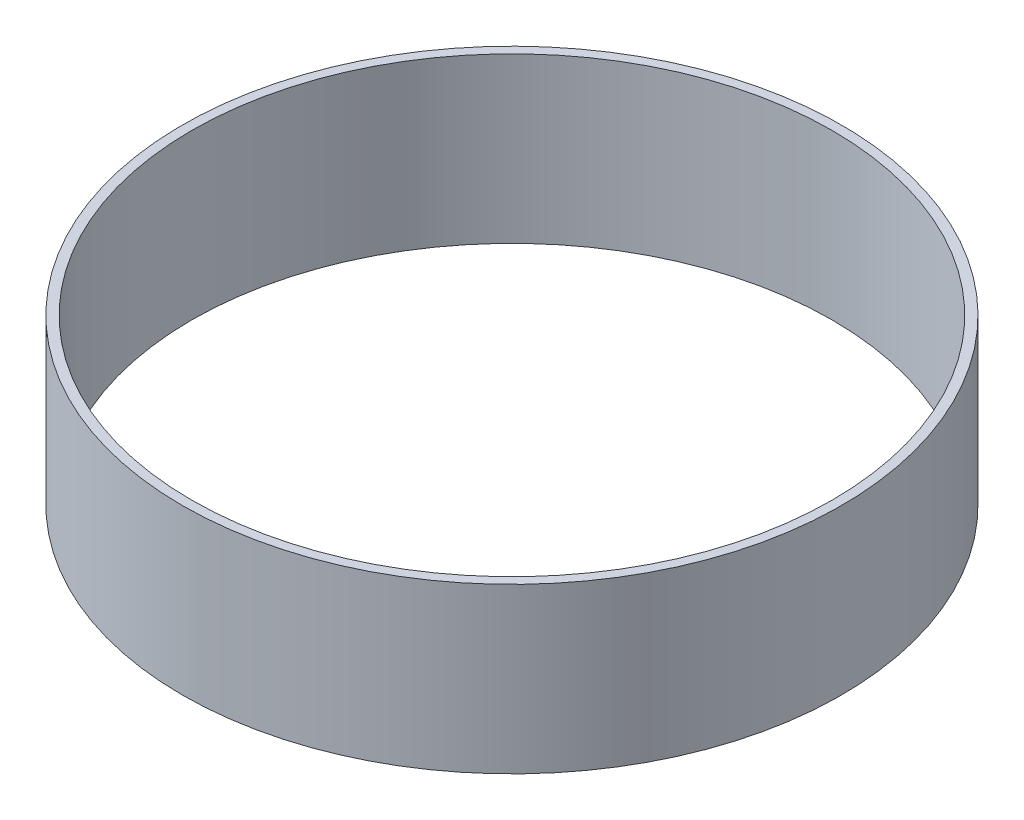
ISO-10303-21;
HEADER;
FILE_DESCRIPTION(('STEP AP214'),'2;1');
FILE_NAME('part.step','',(''),(''),'','','');
FILE_SCHEMA(('AUTOMOTIVE_DESIGN { 1 0 10303 214 1 1 1 1 }'));
ENDSEC;
DATA;
#1=APPLICATION_CONTEXT('core data for automotive mechanical design processes');
#2=APPLICATION_PROTOCOL_DEFINITION('international standard','automotive_design',2000,#1);
#3=PRODUCT_CONTEXT('',#1,'mechanical');
#4=PRODUCT('Part','Part','',(#3));
#5=PRODUCT_RELATED_PRODUCT_CATEGORY('part','',(#4));
#6=PRODUCT_DEFINITION_FORMATION('','',#4);
#7=PRODUCT_DEFINITION_CONTEXT('part definition',#1,'design');
#8=PRODUCT_DEFINITION('design','',#6,#7);
#9=PRODUCT_DEFINITION_SHAPE('','',#8);
#10=(LENGTH_UNIT() NAMED_UNIT(*) SI_UNIT(.MILLI.,.METRE.));
#11=(NAMED_UNIT(*) PLANE_ANGLE_UNIT() SI_UNIT($,.RADIAN.));
#12=(NAMED_UNIT(*) SI_UNIT($,.STERADIAN.) SOLID_ANGLE_UNIT());
#13=UNCERTAINTY_MEASURE_WITH_UNIT(LENGTH_MEASURE(1.E-05),#10,'distance_accuracy_value','');
#14=(GEOMETRIC_REPRESENTATION_CONTEXT(3) GLOBAL_UNCERTAINTY_ASSIGNED_CONTEXT((#13)) GLOBAL_UNIT_ASSIGNED_CONTEXT((#10,
#11,#12)) REPRESENTATION_CONTEXT('',''));
#15=CARTESIAN_POINT('',(0.,0.,0.));
#16=DIRECTION('',(0.,0.,1.));
#17=DIRECTION('',(1.,0.,0.));
#18=AXIS2_PLACEMENT_3D('',#15,#16,#17);
#19=CARTESIAN_POINT('',(0.,25.4,0.));
#20=DIRECTION('',(0.,1.,0.));
#21=DIRECTION('',(0.,0.,1.));
#22=AXIS2_PLACEMENT_3D('',#19,#20,#21);
#23=PLANE('',#22);
#24=CARTESIAN_POINT('',(0.,25.4,0.));
#25=DIRECTION('',(0.,1.,0.));
#26=DIRECTION('',(0.,0.,1.));
#27=AXIS2_PLACEMENT_3D('',#24,#25,#26);
#28=CIRCLE('',#27,51.);
#29=CARTESIAN_POINT('',(0.,25.4,51.));
#30=VERTEX_POINT('',#29);
#31=EDGE_CURVE('E10',#30,#30,#28,.T.);
#32=ORIENTED_EDGE('',*,*,#31,.T.);
#33=EDGE_LOOP('',(#32));
#34=FACE_BOUND('',#33,.T.);
#35=CARTESIAN_POINT('',(0.,25.4,0.));
#36=DIRECTION('',(0.,1.,0.));
#37=DIRECTION('',(0.,0.,1.));
#38=AXIS2_PLACEMENT_3D('',#35,#36,#37);
#39=CIRCLE('',#38,49.55);
#40=CARTESIAN_POINT('',(0.,25.4,49.55));
#41=VERTEX_POINT('',#40);
#42=EDGE_CURVE('E42',#41,#41,#39,.T.);
#43=ORIENTED_EDGE('',*,*,#42,.F.);
#44=EDGE_LOOP('',(#43));
#45=FACE_BOUND('',#44,.T.);
#46=ADVANCED_FACE('F31',(#34,#45),#23,.T.);
#47=CARTESIAN_POINT('',(0.,0.,0.));
#48=DIRECTION('',(0.,1.,0.));
#49=DIRECTION('',(0.,0.,1.));
#50=AXIS2_PLACEMENT_3D('',#47,#48,#49);
#51=PLANE('',#50);
#52=CARTESIAN_POINT('',(0.,0.,0.));
#53=DIRECTION('',(0.,1.,0.));
#54=DIRECTION('',(0.,0.,1.));
#55=AXIS2_PLACEMENT_3D('',#52,#53,#54);
#56=CIRCLE('',#55,51.);
#57=CARTESIAN_POINT('',(0.,0.,51.));
#58=VERTEX_POINT('',#57);
#59=EDGE_CURVE('E35',#58,#58,#56,.T.);
#60=ORIENTED_EDGE('',*,*,#59,.F.);
#61=EDGE_LOOP('',(#60));
#62=FACE_BOUND('',#61,.T.);
#63=CARTESIAN_POINT('',(0.,0.,0.));
#64=DIRECTION('',(0.,1.,0.));
#65=DIRECTION('',(0.,0.,1.));
#66=AXIS2_PLACEMENT_3D('',#63,#64,#65);
#67=CIRCLE('',#66,49.55);
#68=CARTESIAN_POINT('',(0.,0.,49.55));
#69=VERTEX_POINT('',#68);
#70=EDGE_CURVE('E44',#69,#69,#67,.T.);
#71=ORIENTED_EDGE('',*,*,#70,.T.);
#72=EDGE_LOOP('',(#71));
#73=FACE_BOUND('',#72,.T.);
#74=ADVANCED_FACE('F54',(#62,#73),#51,.F.);
#75=CARTESIAN_POINT('',(0.,25.4,0.));
#76=DIRECTION('',(0.,-1.,0.));
#77=DIRECTION('',(0.,0.,-1.));
#78=AXIS2_PLACEMENT_3D('',#75,#76,#77);
#79=CYLINDRICAL_SURFACE('',#78,51.);
#80=ORIENTED_EDGE('',*,*,#31,.F.);
#81=EDGE_LOOP('',(#80));
#82=FACE_BOUND('',#81,.T.);
#83=ORIENTED_EDGE('',*,*,#59,.T.);
#84=EDGE_LOOP('',(#83));
#85=FACE_BOUND('',#84,.T.);
#86=ADVANCED_FACE('F33',(#82,#85),#79,.T.);
#87=CARTESIAN_POINT('',(0.,25.4,0.));
#88=DIRECTION('',(0.,-1.,0.));
#89=DIRECTION('',(0.,0.,-1.));
#90=AXIS2_PLACEMENT_3D('',#87,#88,#89);
#91=CYLINDRICAL_SURFACE('',#90,49.55);
#92=ORIENTED_EDGE('',*,*,#42,.T.);
#93=EDGE_LOOP('',(#92));
#94=FACE_BOUND('',#93,.T.);
#95=ORIENTED_EDGE('',*,*,#70,.F.);
#96=EDGE_LOOP('',(#95));
#97=FACE_BOUND('',#96,.T.);
#98=ADVANCED_FACE('F50',(#94,#97),#91,.F.);
#99=CLOSED_SHELL('',(#46,#74,#86,#98));
#100=MANIFOLD_SOLID_BREP('B2',#99);
#101=ADVANCED_BREP_SHAPE_REPRESENTATION('',(#18,#100),#14);
#102=SHAPE_DEFINITION_REPRESENTATION(#9,#101);
ENDSEC;
END-ISO-10303-21;
